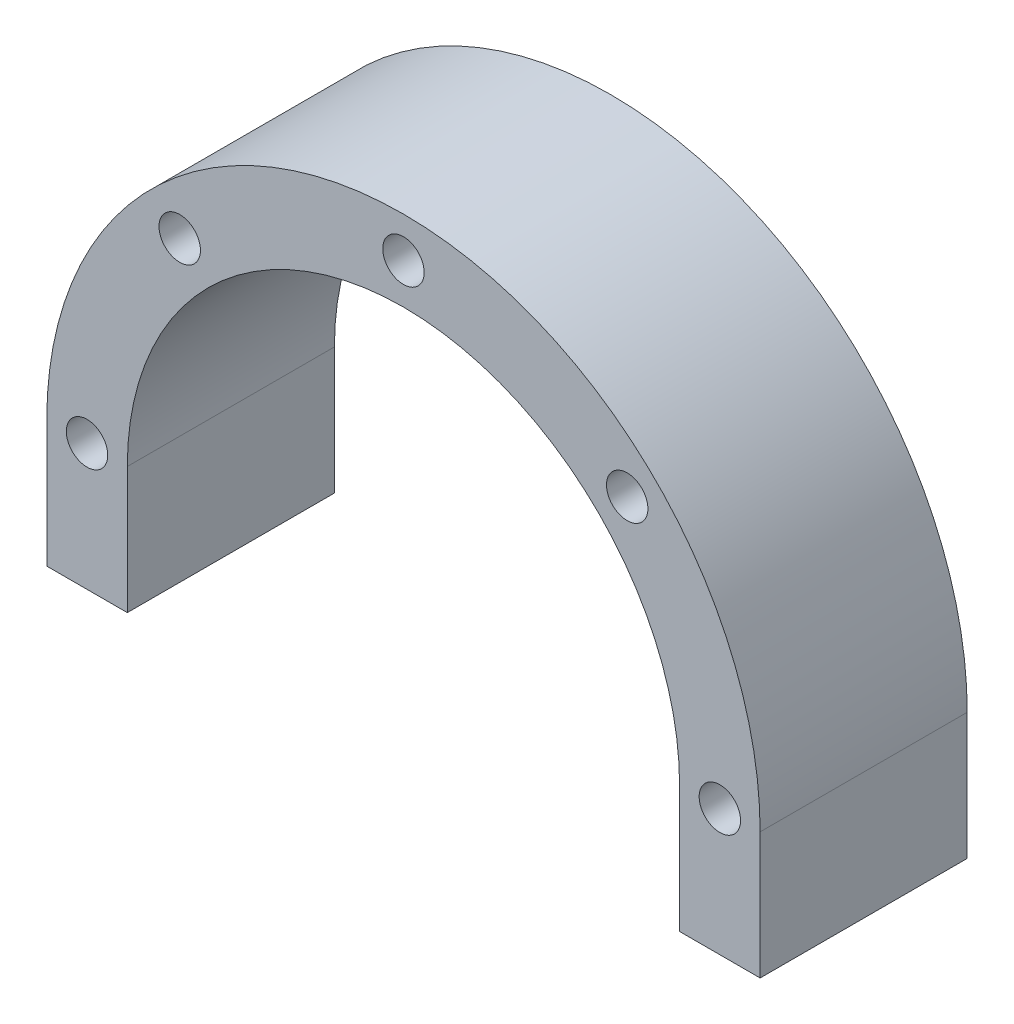
ISO-10303-21;
HEADER;
FILE_DESCRIPTION(('STEP AP214'),'2;1');
FILE_NAME('part.step','',(''),(''),'','','');
FILE_SCHEMA(('AUTOMOTIVE_DESIGN { 1 0 10303 214 1 1 1 1 }'));
ENDSEC;
DATA;
#1=APPLICATION_CONTEXT('core data for automotive mechanical design processes');
#2=APPLICATION_PROTOCOL_DEFINITION('international standard','automotive_design',2000,#1);
#3=PRODUCT_CONTEXT('',#1,'mechanical');
#4=PRODUCT('Part','Part','',(#3));
#5=PRODUCT_RELATED_PRODUCT_CATEGORY('part','',(#4));
#6=PRODUCT_DEFINITION_FORMATION('','',#4);
#7=PRODUCT_DEFINITION_CONTEXT('part definition',#1,'design');
#8=PRODUCT_DEFINITION('design','',#6,#7);
#9=PRODUCT_DEFINITION_SHAPE('','',#8);
#10=(LENGTH_UNIT() NAMED_UNIT(*) SI_UNIT(.MILLI.,.METRE.));
#11=(NAMED_UNIT(*) PLANE_ANGLE_UNIT() SI_UNIT($,.RADIAN.));
#12=(NAMED_UNIT(*) SI_UNIT($,.STERADIAN.) SOLID_ANGLE_UNIT());
#13=UNCERTAINTY_MEASURE_WITH_UNIT(LENGTH_MEASURE(1.E-05),#10,'distance_accuracy_value','');
#14=(GEOMETRIC_REPRESENTATION_CONTEXT(3) GLOBAL_UNCERTAINTY_ASSIGNED_CONTEXT((#13)) GLOBAL_UNIT_ASSIGNED_CONTEXT((#10,
#11,#12)) REPRESENTATION_CONTEXT('',''));
#15=CARTESIAN_POINT('',(0.,0.,0.));
#16=DIRECTION('',(0.,0.,1.));
#17=DIRECTION('',(1.,0.,0.));
#18=AXIS2_PLACEMENT_3D('',#15,#16,#17);
#19=CARTESIAN_POINT('',(0.,-11.,18.));
#20=DIRECTION('',(0.,1.,0.));
#21=DIRECTION('',(0.,0.,1.));
#22=AXIS2_PLACEMENT_3D('',#19,#20,#21);
#23=PLANE('',#22);
#24=DIRECTION('',(1.,0.,0.));
#25=VECTOR('',#24,1.);
#26=CARTESIAN_POINT('',(0.,-11.,0.));
#27=LINE('',#26,#25);
#28=CARTESIAN_POINT('',(-31.,-11.,0.));
#29=VERTEX_POINT('',#28);
#30=CARTESIAN_POINT('',(-24.,-11.,0.));
#31=VERTEX_POINT('',#30);
#32=EDGE_CURVE('E129',#29,#31,#27,.T.);
#33=ORIENTED_EDGE('',*,*,#32,.T.);
#34=DIRECTION('',(0.,0.,1.));
#35=VECTOR('',#34,1.);
#36=CARTESIAN_POINT('',(-24.,-11.,0.));
#37=LINE('',#36,#35);
#38=CARTESIAN_POINT('',(-24.,-11.,18.));
#39=VERTEX_POINT('',#38);
#40=EDGE_CURVE('E164',#31,#39,#37,.T.);
#41=ORIENTED_EDGE('',*,*,#40,.T.);
#42=DIRECTION('',(1.,0.,0.));
#43=VECTOR('',#42,1.);
#44=CARTESIAN_POINT('',(0.,-11.,18.));
#45=LINE('',#44,#43);
#46=CARTESIAN_POINT('',(-31.,-11.,18.));
#47=VERTEX_POINT('',#46);
#48=EDGE_CURVE('E148',#47,#39,#45,.T.);
#49=ORIENTED_EDGE('',*,*,#48,.F.);
#50=DIRECTION('',(0.,0.,-1.));
#51=VECTOR('',#50,1.);
#52=CARTESIAN_POINT('',(-31.,-11.,18.));
#53=LINE('',#52,#51);
#54=EDGE_CURVE('E43',#47,#29,#53,.T.);
#55=ORIENTED_EDGE('',*,*,#54,.T.);
#56=EDGE_LOOP('',(#33,#41,#49,#55));
#57=FACE_BOUND('',#56,.T.);
#58=ADVANCED_FACE('F35',(#57),#23,.F.);
#59=CARTESIAN_POINT('',(0.,0.,18.));
#60=DIRECTION('',(0.,0.,-1.));
#61=DIRECTION('',(-1.,0.,0.));
#62=AXIS2_PLACEMENT_3D('',#59,#60,#61);
#63=CYLINDRICAL_SURFACE('',#62,31.);
#64=CARTESIAN_POINT('',(0.,0.,0.));
#65=DIRECTION('',(0.,0.,1.));
#66=DIRECTION('',(1.,0.,0.));
#67=AXIS2_PLACEMENT_3D('',#64,#65,#66);
#68=CIRCLE('',#67,31.);
#69=CARTESIAN_POINT('',(-31.,0.,0.));
#70=VERTEX_POINT('',#69);
#71=CARTESIAN_POINT('',(31.,0.,0.));
#72=VERTEX_POINT('',#71);
#73=EDGE_CURVE('E133',#70,#72,#68,.F.);
#74=ORIENTED_EDGE('',*,*,#73,.F.);
#75=DIRECTION('',(0.,0.,-1.));
#76=VECTOR('',#75,1.);
#77=CARTESIAN_POINT('',(-31.,0.,18.));
#78=LINE('',#77,#76);
#79=CARTESIAN_POINT('',(-31.,0.,18.));
#80=VERTEX_POINT('',#79);
#81=EDGE_CURVE('E11',#80,#70,#78,.T.);
#82=ORIENTED_EDGE('',*,*,#81,.F.);
#83=CARTESIAN_POINT('',(0.,0.,18.));
#84=DIRECTION('',(0.,0.,1.));
#85=DIRECTION('',(1.,0.,0.));
#86=AXIS2_PLACEMENT_3D('',#83,#84,#85);
#87=CIRCLE('',#86,31.);
#88=CARTESIAN_POINT('',(31.,0.,18.));
#89=VERTEX_POINT('',#88);
#90=EDGE_CURVE('E138',#80,#89,#87,.F.);
#91=ORIENTED_EDGE('',*,*,#90,.T.);
#92=DIRECTION('',(0.,0.,-1.));
#93=VECTOR('',#92,1.);
#94=CARTESIAN_POINT('',(31.,0.,18.));
#95=LINE('',#94,#93);
#96=EDGE_CURVE('E79',#89,#72,#95,.T.);
#97=ORIENTED_EDGE('',*,*,#96,.T.);
#98=EDGE_LOOP('',(#74,#82,#91,#97));
#99=FACE_BOUND('',#98,.T.);
#100=ADVANCED_FACE('F37',(#99),#63,.T.);
#101=CARTESIAN_POINT('',(-31.,0.,18.));
#102=DIRECTION('',(1.,0.,0.));
#103=DIRECTION('',(0.,0.,-1.));
#104=AXIS2_PLACEMENT_3D('',#101,#102,#103);
#105=PLANE('',#104);
#106=DIRECTION('',(0.,-1.,0.));
#107=VECTOR('',#106,1.);
#108=CARTESIAN_POINT('',(-31.,0.,0.));
#109=LINE('',#108,#107);
#110=EDGE_CURVE('E130',#70,#29,#109,.T.);
#111=ORIENTED_EDGE('',*,*,#110,.T.);
#112=ORIENTED_EDGE('',*,*,#54,.F.);
#113=DIRECTION('',(0.,-1.,0.));
#114=VECTOR('',#113,1.);
#115=CARTESIAN_POINT('',(-31.,0.,18.));
#116=LINE('',#115,#114);
#117=EDGE_CURVE('E170',#80,#47,#116,.T.);
#118=ORIENTED_EDGE('',*,*,#117,.F.);
#119=ORIENTED_EDGE('',*,*,#81,.T.);
#120=EDGE_LOOP('',(#111,#112,#118,#119));
#121=FACE_BOUND('',#120,.T.);
#122=ADVANCED_FACE('F174',(#121),#105,.F.);
#123=CARTESIAN_POINT('',(24.,-11.,18.));
#124=VERTEX_POINT('',#123);
#125=CARTESIAN_POINT('',(31.,-11.,18.));
#126=VERTEX_POINT('',#125);
#127=EDGE_CURVE('E122',#124,#126,#45,.T.);
#128=ORIENTED_EDGE('',*,*,#127,.F.);
#129=DIRECTION('',(0.,0.,1.));
#130=VECTOR('',#129,1.);
#131=CARTESIAN_POINT('',(24.,-11.,0.));
#132=LINE('',#131,#130);
#133=CARTESIAN_POINT('',(24.,-11.,0.));
#134=VERTEX_POINT('',#133);
#135=EDGE_CURVE('E109',#134,#124,#132,.T.);
#136=ORIENTED_EDGE('',*,*,#135,.F.);
#137=CARTESIAN_POINT('',(31.,-11.,0.));
#138=VERTEX_POINT('',#137);
#139=EDGE_CURVE('E120',#134,#138,#27,.T.);
#140=ORIENTED_EDGE('',*,*,#139,.T.);
#141=DIRECTION('',(0.,0.,-1.));
#142=VECTOR('',#141,1.);
#143=CARTESIAN_POINT('',(31.,-11.,18.));
#144=LINE('',#143,#142);
#145=EDGE_CURVE('E140',#126,#138,#144,.T.);
#146=ORIENTED_EDGE('',*,*,#145,.F.);
#147=EDGE_LOOP('',(#128,#136,#140,#146));
#148=FACE_BOUND('',#147,.T.);
#149=ADVANCED_FACE('F118',(#148),#23,.F.);
#150=CARTESIAN_POINT('',(31.,0.,18.));
#151=DIRECTION('',(-1.,0.,0.));
#152=DIRECTION('',(0.,-1.,0.));
#153=AXIS2_PLACEMENT_3D('',#150,#151,#152);
#154=PLANE('',#153);
#155=DIRECTION('',(0.,1.,0.));
#156=VECTOR('',#155,1.);
#157=CARTESIAN_POINT('',(31.,0.,0.));
#158=LINE('',#157,#156);
#159=EDGE_CURVE('E128',#138,#72,#158,.T.);
#160=ORIENTED_EDGE('',*,*,#159,.T.);
#161=ORIENTED_EDGE('',*,*,#96,.F.);
#162=DIRECTION('',(0.,1.,0.));
#163=VECTOR('',#162,1.);
#164=CARTESIAN_POINT('',(31.,0.,18.));
#165=LINE('',#164,#163);
#166=EDGE_CURVE('E59',#126,#89,#165,.T.);
#167=ORIENTED_EDGE('',*,*,#166,.F.);
#168=ORIENTED_EDGE('',*,*,#145,.T.);
#169=EDGE_LOOP('',(#160,#161,#167,#168));
#170=FACE_BOUND('',#169,.T.);
#171=ADVANCED_FACE('F184',(#170),#154,.F.);
#172=CARTESIAN_POINT('',(0.,0.,18.));
#173=DIRECTION('',(0.,0.,1.));
#174=DIRECTION('',(1.,0.,0.));
#175=AXIS2_PLACEMENT_3D('',#172,#173,#174);
#176=PLANE('',#175);
#177=CARTESIAN_POINT('',(-19.4454364826298,19.4454364826303,18.));
#178=DIRECTION('',(0.,0.,1.));
#179=DIRECTION('',(1.,0.,0.));
#180=AXIS2_PLACEMENT_3D('',#177,#178,#179);
#181=CIRCLE('',#180,1.8);
#182=CARTESIAN_POINT('',(-17.6454364826298,19.4454364826303,18.));
#183=VERTEX_POINT('',#182);
#184=EDGE_CURVE('E234',#183,#183,#181,.T.);
#185=ORIENTED_EDGE('',*,*,#184,.F.);
#186=EDGE_LOOP('',(#185));
#187=FACE_BOUND('',#186,.T.);
#188=CARTESIAN_POINT('',(-27.5,2.88047210454558E-13,18.));
#189=DIRECTION('',(0.,0.,1.));
#190=DIRECTION('',(1.,0.,0.));
#191=AXIS2_PLACEMENT_3D('',#188,#189,#190);
#192=CIRCLE('',#191,1.8);
#193=CARTESIAN_POINT('',(-25.7,2.88047210454558E-13,18.));
#194=VERTEX_POINT('',#193);
#195=EDGE_CURVE('E236',#194,#194,#192,.T.);
#196=ORIENTED_EDGE('',*,*,#195,.F.);
#197=EDGE_LOOP('',(#196));
#198=FACE_BOUND('',#197,.T.);
#199=CARTESIAN_POINT('',(27.5,0.,18.));
#200=DIRECTION('',(0.,0.,1.));
#201=DIRECTION('',(1.,0.,0.));
#202=AXIS2_PLACEMENT_3D('',#199,#200,#201);
#203=CIRCLE('',#202,1.8);
#204=CARTESIAN_POINT('',(29.3,0.,18.));
#205=VERTEX_POINT('',#204);
#206=EDGE_CURVE('E244',#205,#205,#203,.T.);
#207=ORIENTED_EDGE('',*,*,#206,.F.);
#208=EDGE_LOOP('',(#207));
#209=FACE_BOUND('',#208,.T.);
#210=CARTESIAN_POINT('',(19.4454364826301,19.44543648263,18.));
#211=DIRECTION('',(0.,0.,1.));
#212=DIRECTION('',(1.,0.,0.));
#213=AXIS2_PLACEMENT_3D('',#210,#211,#212);
#214=CIRCLE('',#213,1.8);
#215=CARTESIAN_POINT('',(21.2454364826301,19.44543648263,18.));
#216=VERTEX_POINT('',#215);
#217=EDGE_CURVE('E250',#216,#216,#214,.T.);
#218=ORIENTED_EDGE('',*,*,#217,.F.);
#219=EDGE_LOOP('',(#218));
#220=FACE_BOUND('',#219,.T.);
#221=CARTESIAN_POINT('',(0.,27.5,18.));
#222=DIRECTION('',(0.,0.,1.));
#223=DIRECTION('',(1.,0.,0.));
#224=AXIS2_PLACEMENT_3D('',#221,#222,#223);
#225=CIRCLE('',#224,1.8);
#226=CARTESIAN_POINT('',(1.8,27.5,18.));
#227=VERTEX_POINT('',#226);
#228=EDGE_CURVE('E256',#227,#227,#225,.T.);
#229=ORIENTED_EDGE('',*,*,#228,.F.);
#230=EDGE_LOOP('',(#229));
#231=FACE_BOUND('',#230,.T.);
#232=DIRECTION('',(0.,-1.,0.));
#233=VECTOR('',#232,1.);
#234=CARTESIAN_POINT('',(-24.,0.,18.));
#235=LINE('',#234,#233);
#236=CARTESIAN_POINT('',(-24.,0.,18.));
#237=VERTEX_POINT('',#236);
#238=EDGE_CURVE('E114',#237,#39,#235,.T.);
#239=ORIENTED_EDGE('',*,*,#238,.F.);
#240=CARTESIAN_POINT('',(0.,0.,18.));
#241=DIRECTION('',(0.,0.,1.));
#242=DIRECTION('',(1.,0.,0.));
#243=AXIS2_PLACEMENT_3D('',#240,#241,#242);
#244=CIRCLE('',#243,24.);
#245=CARTESIAN_POINT('',(24.,0.,18.));
#246=VERTEX_POINT('',#245);
#247=EDGE_CURVE('E159',#246,#237,#244,.T.);
#248=ORIENTED_EDGE('',*,*,#247,.F.);
#249=DIRECTION('',(0.,1.,0.));
#250=VECTOR('',#249,1.);
#251=CARTESIAN_POINT('',(24.,-11.,18.));
#252=LINE('',#251,#250);
#253=EDGE_CURVE('E157',#124,#246,#252,.T.);
#254=ORIENTED_EDGE('',*,*,#253,.F.);
#255=ORIENTED_EDGE('',*,*,#127,.T.);
#256=ORIENTED_EDGE('',*,*,#166,.T.);
#257=ORIENTED_EDGE('',*,*,#90,.F.);
#258=ORIENTED_EDGE('',*,*,#117,.T.);
#259=ORIENTED_EDGE('',*,*,#48,.T.);
#260=EDGE_LOOP('',(#239,#248,#254,#255,#256,#257,#258,#259));
#261=FACE_BOUND('',#260,.T.);
#262=ADVANCED_FACE('F188',(#187,#198,#209,#220,#231,#261),#176,.T.);
#263=CARTESIAN_POINT('',(0.,0.,0.));
#264=DIRECTION('',(0.,0.,1.));
#265=DIRECTION('',(1.,0.,0.));
#266=AXIS2_PLACEMENT_3D('',#263,#264,#265);
#267=PLANE('',#266);
#268=CARTESIAN_POINT('',(-19.4454364826298,19.4454364826303,0.));
#269=DIRECTION('',(0.,0.,1.));
#270=DIRECTION('',(1.,0.,0.));
#271=AXIS2_PLACEMENT_3D('',#268,#269,#270);
#272=CIRCLE('',#271,1.8);
#273=CARTESIAN_POINT('',(-17.6454364826298,19.4454364826303,0.));
#274=VERTEX_POINT('',#273);
#275=EDGE_CURVE('E231',#274,#274,#272,.T.);
#276=ORIENTED_EDGE('',*,*,#275,.T.);
#277=EDGE_LOOP('',(#276));
#278=FACE_BOUND('',#277,.T.);
#279=CARTESIAN_POINT('',(-27.5,2.88047210454558E-13,0.));
#280=DIRECTION('',(0.,0.,1.));
#281=DIRECTION('',(1.,0.,0.));
#282=AXIS2_PLACEMENT_3D('',#279,#280,#281);
#283=CIRCLE('',#282,1.8);
#284=CARTESIAN_POINT('',(-25.7,2.88047210454558E-13,0.));
#285=VERTEX_POINT('',#284);
#286=EDGE_CURVE('E241',#285,#285,#283,.T.);
#287=ORIENTED_EDGE('',*,*,#286,.T.);
#288=EDGE_LOOP('',(#287));
#289=FACE_BOUND('',#288,.T.);
#290=CARTESIAN_POINT('',(27.5,0.,0.));
#291=DIRECTION('',(0.,0.,1.));
#292=DIRECTION('',(1.,0.,0.));
#293=AXIS2_PLACEMENT_3D('',#290,#291,#292);
#294=CIRCLE('',#293,1.8);
#295=CARTESIAN_POINT('',(29.3,0.,0.));
#296=VERTEX_POINT('',#295);
#297=EDGE_CURVE('E247',#296,#296,#294,.T.);
#298=ORIENTED_EDGE('',*,*,#297,.T.);
#299=EDGE_LOOP('',(#298));
#300=FACE_BOUND('',#299,.T.);
#301=CARTESIAN_POINT('',(19.4454364826301,19.44543648263,0.));
#302=DIRECTION('',(0.,0.,1.));
#303=DIRECTION('',(1.,0.,0.));
#304=AXIS2_PLACEMENT_3D('',#301,#302,#303);
#305=CIRCLE('',#304,1.8);
#306=CARTESIAN_POINT('',(21.2454364826301,19.44543648263,0.));
#307=VERTEX_POINT('',#306);
#308=EDGE_CURVE('E253',#307,#307,#305,.T.);
#309=ORIENTED_EDGE('',*,*,#308,.T.);
#310=EDGE_LOOP('',(#309));
#311=FACE_BOUND('',#310,.T.);
#312=CARTESIAN_POINT('',(0.,27.5,0.));
#313=DIRECTION('',(0.,0.,1.));
#314=DIRECTION('',(1.,0.,0.));
#315=AXIS2_PLACEMENT_3D('',#312,#313,#314);
#316=CIRCLE('',#315,1.8);
#317=CARTESIAN_POINT('',(1.8,27.5,0.));
#318=VERTEX_POINT('',#317);
#319=EDGE_CURVE('E160',#318,#318,#316,.T.);
#320=ORIENTED_EDGE('',*,*,#319,.T.);
#321=EDGE_LOOP('',(#320));
#322=FACE_BOUND('',#321,.T.);
#323=CARTESIAN_POINT('',(0.,0.,0.));
#324=DIRECTION('',(0.,0.,1.));
#325=DIRECTION('',(1.,0.,0.));
#326=AXIS2_PLACEMENT_3D('',#323,#324,#325);
#327=CIRCLE('',#326,24.);
#328=CARTESIAN_POINT('',(24.,0.,0.));
#329=VERTEX_POINT('',#328);
#330=CARTESIAN_POINT('',(-24.,0.,0.));
#331=VERTEX_POINT('',#330);
#332=EDGE_CURVE('E50',#329,#331,#327,.T.);
#333=ORIENTED_EDGE('',*,*,#332,.T.);
#334=DIRECTION('',(0.,-1.,0.));
#335=VECTOR('',#334,1.);
#336=CARTESIAN_POINT('',(-24.,0.,0.));
#337=LINE('',#336,#335);
#338=EDGE_CURVE('E123',#331,#31,#337,.T.);
#339=ORIENTED_EDGE('',*,*,#338,.T.);
#340=ORIENTED_EDGE('',*,*,#32,.F.);
#341=ORIENTED_EDGE('',*,*,#110,.F.);
#342=ORIENTED_EDGE('',*,*,#73,.T.);
#343=ORIENTED_EDGE('',*,*,#159,.F.);
#344=ORIENTED_EDGE('',*,*,#139,.F.);
#345=DIRECTION('',(0.,1.,0.));
#346=VECTOR('',#345,1.);
#347=CARTESIAN_POINT('',(24.,-11.,0.));
#348=LINE('',#347,#346);
#349=EDGE_CURVE('E105',#134,#329,#348,.T.);
#350=ORIENTED_EDGE('',*,*,#349,.T.);
#351=EDGE_LOOP('',(#333,#339,#340,#341,#342,#343,#344,#350));
#352=FACE_BOUND('',#351,.T.);
#353=ADVANCED_FACE('F126',(#278,#289,#300,#311,#322,#352),#267,.F.);
#354=CARTESIAN_POINT('',(-24.,0.,0.));
#355=DIRECTION('',(-1.,0.,0.));
#356=DIRECTION('',(0.,0.,1.));
#357=AXIS2_PLACEMENT_3D('',#354,#355,#356);
#358=PLANE('',#357);
#359=ORIENTED_EDGE('',*,*,#238,.T.);
#360=ORIENTED_EDGE('',*,*,#40,.F.);
#361=ORIENTED_EDGE('',*,*,#338,.F.);
#362=DIRECTION('',(0.,0.,1.));
#363=VECTOR('',#362,1.);
#364=CARTESIAN_POINT('',(-24.,0.,0.));
#365=LINE('',#364,#363);
#366=EDGE_CURVE('E166',#331,#237,#365,.T.);
#367=ORIENTED_EDGE('',*,*,#366,.T.);
#368=EDGE_LOOP('',(#359,#360,#361,#367));
#369=FACE_BOUND('',#368,.T.);
#370=ADVANCED_FACE('F197',(#369),#358,.F.);
#371=CARTESIAN_POINT('',(0.,0.,0.));
#372=DIRECTION('',(0.,0.,1.));
#373=DIRECTION('',(1.,0.,0.));
#374=AXIS2_PLACEMENT_3D('',#371,#372,#373);
#375=CYLINDRICAL_SURFACE('',#374,24.);
#376=ORIENTED_EDGE('',*,*,#247,.T.);
#377=ORIENTED_EDGE('',*,*,#366,.F.);
#378=ORIENTED_EDGE('',*,*,#332,.F.);
#379=DIRECTION('',(0.,0.,1.));
#380=VECTOR('',#379,1.);
#381=CARTESIAN_POINT('',(24.,0.,0.));
#382=LINE('',#381,#380);
#383=EDGE_CURVE('E111',#329,#246,#382,.T.);
#384=ORIENTED_EDGE('',*,*,#383,.T.);
#385=EDGE_LOOP('',(#376,#377,#378,#384));
#386=FACE_BOUND('',#385,.T.);
#387=ADVANCED_FACE('F203',(#386),#375,.F.);
#388=CARTESIAN_POINT('',(24.,-11.,0.));
#389=DIRECTION('',(1.,0.,0.));
#390=DIRECTION('',(0.,0.,-1.));
#391=AXIS2_PLACEMENT_3D('',#388,#389,#390);
#392=PLANE('',#391);
#393=ORIENTED_EDGE('',*,*,#253,.T.);
#394=ORIENTED_EDGE('',*,*,#383,.F.);
#395=ORIENTED_EDGE('',*,*,#349,.F.);
#396=ORIENTED_EDGE('',*,*,#135,.T.);
#397=EDGE_LOOP('',(#393,#394,#395,#396));
#398=FACE_BOUND('',#397,.T.);
#399=ADVANCED_FACE('F108',(#398),#392,.F.);
#400=CARTESIAN_POINT('',(0.,27.5,18.));
#401=DIRECTION('',(0.,0.,1.));
#402=DIRECTION('',(1.,0.,0.));
#403=AXIS2_PLACEMENT_3D('',#400,#401,#402);
#404=CYLINDRICAL_SURFACE('',#403,1.8);
#405=ORIENTED_EDGE('',*,*,#319,.F.);
#406=EDGE_LOOP('',(#405));
#407=FACE_BOUND('',#406,.T.);
#408=ORIENTED_EDGE('',*,*,#228,.T.);
#409=EDGE_LOOP('',(#408));
#410=FACE_BOUND('',#409,.T.);
#411=ADVANCED_FACE('F202',(#407,#410),#404,.F.);
#412=CARTESIAN_POINT('',(19.4454364826301,19.44543648263,18.));
#413=DIRECTION('',(0.,0.,1.));
#414=DIRECTION('',(1.,0.,0.));
#415=AXIS2_PLACEMENT_3D('',#412,#413,#414);
#416=CYLINDRICAL_SURFACE('',#415,1.8);
#417=ORIENTED_EDGE('',*,*,#308,.F.);
#418=EDGE_LOOP('',(#417));
#419=FACE_BOUND('',#418,.T.);
#420=ORIENTED_EDGE('',*,*,#217,.T.);
#421=EDGE_LOOP('',(#420));
#422=FACE_BOUND('',#421,.T.);
#423=ADVANCED_FACE('F210',(#419,#422),#416,.F.);
#424=CARTESIAN_POINT('',(27.5,0.,18.));
#425=DIRECTION('',(0.,0.,1.));
#426=DIRECTION('',(1.,0.,0.));
#427=AXIS2_PLACEMENT_3D('',#424,#425,#426);
#428=CYLINDRICAL_SURFACE('',#427,1.8);
#429=ORIENTED_EDGE('',*,*,#297,.F.);
#430=EDGE_LOOP('',(#429));
#431=FACE_BOUND('',#430,.T.);
#432=ORIENTED_EDGE('',*,*,#206,.T.);
#433=EDGE_LOOP('',(#432));
#434=FACE_BOUND('',#433,.T.);
#435=ADVANCED_FACE('F214',(#431,#434),#428,.F.);
#436=CARTESIAN_POINT('',(-27.5,2.88047210454558E-13,18.));
#437=DIRECTION('',(0.,0.,1.));
#438=DIRECTION('',(1.,0.,0.));
#439=AXIS2_PLACEMENT_3D('',#436,#437,#438);
#440=CYLINDRICAL_SURFACE('',#439,1.8);
#441=ORIENTED_EDGE('',*,*,#286,.F.);
#442=EDGE_LOOP('',(#441));
#443=FACE_BOUND('',#442,.T.);
#444=ORIENTED_EDGE('',*,*,#195,.T.);
#445=EDGE_LOOP('',(#444));
#446=FACE_BOUND('',#445,.T.);
#447=ADVANCED_FACE('F218',(#443,#446),#440,.F.);
#448=CARTESIAN_POINT('',(-19.4454364826298,19.4454364826303,18.));
#449=DIRECTION('',(0.,0.,1.));
#450=DIRECTION('',(1.,0.,0.));
#451=AXIS2_PLACEMENT_3D('',#448,#449,#450);
#452=CYLINDRICAL_SURFACE('',#451,1.8);
#453=ORIENTED_EDGE('',*,*,#275,.F.);
#454=EDGE_LOOP('',(#453));
#455=FACE_BOUND('',#454,.T.);
#456=ORIENTED_EDGE('',*,*,#184,.T.);
#457=EDGE_LOOP('',(#456));
#458=FACE_BOUND('',#457,.T.);
#459=ADVANCED_FACE('F222',(#455,#458),#452,.F.);
#460=CLOSED_SHELL('',(#58,#100,#122,#149,#171,#262,#353,#370,#387,#399,#411,#423,#435,#447,#459));
#461=MANIFOLD_SOLID_BREP('B2',#460);
#462=ADVANCED_BREP_SHAPE_REPRESENTATION('',(#18,#461),#14);
#463=SHAPE_DEFINITION_REPRESENTATION(#9,#462);
ENDSEC;
END-ISO-10303-21;
